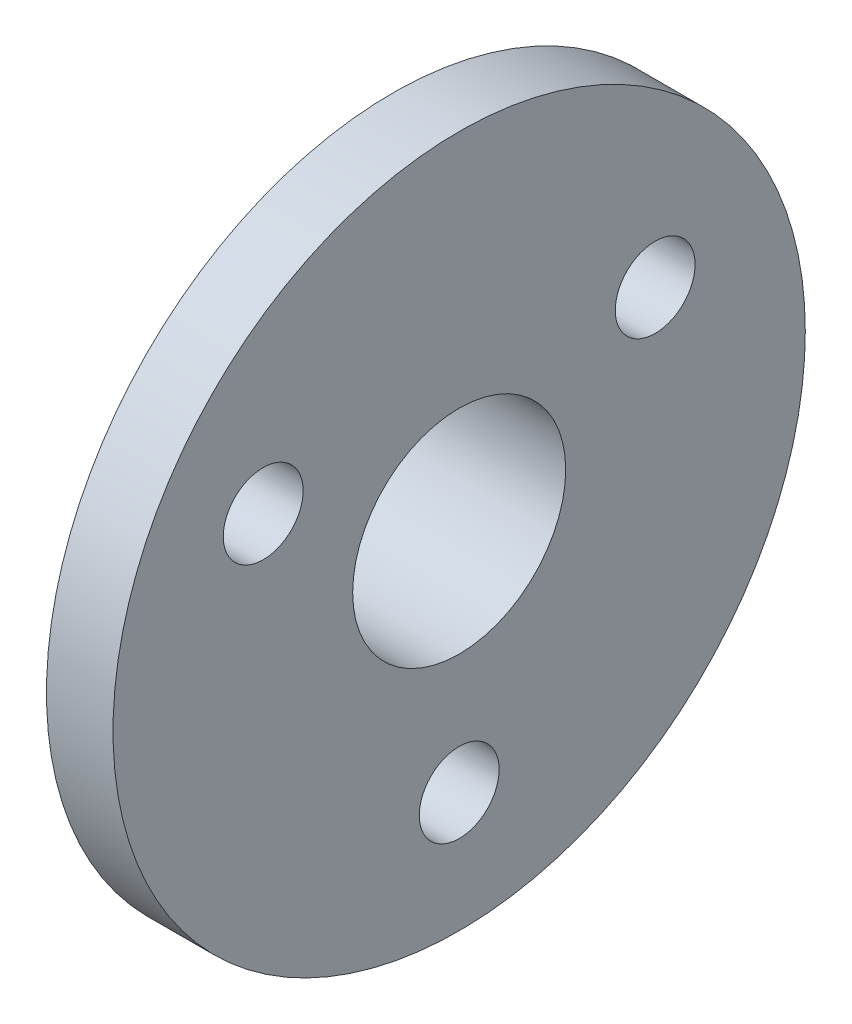
ISO-10303-21;
HEADER;
FILE_DESCRIPTION(('STEP AP214'),'2;1');
FILE_NAME('part.step','',(''),(''),'','','');
FILE_SCHEMA(('AUTOMOTIVE_DESIGN { 1 0 10303 214 1 1 1 1 }'));
ENDSEC;
DATA;
#1=APPLICATION_CONTEXT('core data for automotive mechanical design processes');
#2=APPLICATION_PROTOCOL_DEFINITION('international standard','automotive_design',2000,#1);
#3=PRODUCT_CONTEXT('',#1,'mechanical');
#4=PRODUCT('Part','Part','',(#3));
#5=PRODUCT_RELATED_PRODUCT_CATEGORY('part','',(#4));
#6=PRODUCT_DEFINITION_FORMATION('','',#4);
#7=PRODUCT_DEFINITION_CONTEXT('part definition',#1,'design');
#8=PRODUCT_DEFINITION('design','',#6,#7);
#9=PRODUCT_DEFINITION_SHAPE('','',#8);
#10=(LENGTH_UNIT() NAMED_UNIT(*) SI_UNIT(.MILLI.,.METRE.));
#11=(NAMED_UNIT(*) PLANE_ANGLE_UNIT() SI_UNIT($,.RADIAN.));
#12=(NAMED_UNIT(*) SI_UNIT($,.STERADIAN.) SOLID_ANGLE_UNIT());
#13=UNCERTAINTY_MEASURE_WITH_UNIT(LENGTH_MEASURE(1.E-05),#10,'distance_accuracy_value','');
#14=(GEOMETRIC_REPRESENTATION_CONTEXT(3) GLOBAL_UNCERTAINTY_ASSIGNED_CONTEXT((#13)) GLOBAL_UNIT_ASSIGNED_CONTEXT((#10,
#11,#12)) REPRESENTATION_CONTEXT('',''));
#15=CARTESIAN_POINT('',(0.,0.,0.));
#16=DIRECTION('',(0.,0.,1.));
#17=DIRECTION('',(1.,0.,0.));
#18=AXIS2_PLACEMENT_3D('',#15,#16,#17);
#19=CARTESIAN_POINT('',(7.,0.,0.));
#20=DIRECTION('',(-1.,0.,0.));
#21=DIRECTION('',(0.,0.,1.));
#22=AXIS2_PLACEMENT_3D('',#19,#20,#21);
#23=CYLINDRICAL_SURFACE('',#22,12.5);
#24=CARTESIAN_POINT('',(7.,0.,0.));
#25=DIRECTION('',(1.,0.,0.));
#26=DIRECTION('',(0.,0.,-1.));
#27=AXIS2_PLACEMENT_3D('',#24,#25,#26);
#28=CIRCLE('',#27,12.5);
#29=CARTESIAN_POINT('',(7.,0.,-12.5));
#30=VERTEX_POINT('',#29);
#31=EDGE_CURVE('E10',#30,#30,#28,.T.);
#32=ORIENTED_EDGE('',*,*,#31,.F.);
#33=EDGE_LOOP('',(#32));
#34=FACE_BOUND('',#33,.T.);
#35=CARTESIAN_POINT('',(0.,0.,0.));
#36=DIRECTION('',(1.,0.,0.));
#37=DIRECTION('',(0.,0.,-1.));
#38=AXIS2_PLACEMENT_3D('',#35,#36,#37);
#39=CIRCLE('',#38,12.5);
#40=CARTESIAN_POINT('',(0.,0.,-12.5));
#41=VERTEX_POINT('',#40);
#42=EDGE_CURVE('E49',#41,#41,#39,.T.);
#43=ORIENTED_EDGE('',*,*,#42,.T.);
#44=EDGE_LOOP('',(#43));
#45=FACE_BOUND('',#44,.T.);
#46=ADVANCED_FACE('F41',(#34,#45),#23,.T.);
#47=CARTESIAN_POINT('',(0.,0.,0.));
#48=DIRECTION('',(1.,0.,0.));
#49=DIRECTION('',(0.,0.,-1.));
#50=AXIS2_PLACEMENT_3D('',#47,#48,#49);
#51=PLANE('',#50);
#52=CARTESIAN_POINT('',(0.,0.,0.));
#53=DIRECTION('',(1.,0.,0.));
#54=DIRECTION('',(0.,0.,-1.));
#55=AXIS2_PLACEMENT_3D('',#52,#53,#54);
#56=CIRCLE('',#55,8.);
#57=CARTESIAN_POINT('',(0.,0.,-8.));
#58=VERTEX_POINT('',#57);
#59=EDGE_CURVE('E87',#58,#58,#56,.T.);
#60=ORIENTED_EDGE('',*,*,#59,.T.);
#61=EDGE_LOOP('',(#60));
#62=FACE_BOUND('',#61,.T.);
#63=ORIENTED_EDGE('',*,*,#42,.F.);
#64=EDGE_LOOP('',(#63));
#65=FACE_BOUND('',#64,.T.);
#66=ADVANCED_FACE('F120',(#62,#65),#51,.F.);
#67=CARTESIAN_POINT('',(12.,0.,0.));
#68=DIRECTION('',(-1.,0.,0.));
#69=DIRECTION('',(0.,0.,1.));
#70=AXIS2_PLACEMENT_3D('',#67,#68,#69);
#71=CYLINDRICAL_SURFACE('',#70,26.);
#72=CARTESIAN_POINT('',(12.,0.,0.));
#73=DIRECTION('',(1.,0.,0.));
#74=DIRECTION('',(0.,0.,-1.));
#75=AXIS2_PLACEMENT_3D('',#72,#73,#74);
#76=CIRCLE('',#75,26.);
#77=CARTESIAN_POINT('',(12.,0.,-26.));
#78=VERTEX_POINT('',#77);
#79=EDGE_CURVE('E55',#78,#78,#76,.T.);
#80=ORIENTED_EDGE('',*,*,#79,.F.);
#81=EDGE_LOOP('',(#80));
#82=FACE_BOUND('',#81,.T.);
#83=CARTESIAN_POINT('',(7.,0.,0.));
#84=DIRECTION('',(1.,0.,0.));
#85=DIRECTION('',(0.,0.,-1.));
#86=AXIS2_PLACEMENT_3D('',#83,#84,#85);
#87=CIRCLE('',#86,26.);
#88=CARTESIAN_POINT('',(7.,0.,-26.));
#89=VERTEX_POINT('',#88);
#90=EDGE_CURVE('E58',#89,#89,#87,.T.);
#91=ORIENTED_EDGE('',*,*,#90,.T.);
#92=EDGE_LOOP('',(#91));
#93=FACE_BOUND('',#92,.T.);
#94=ADVANCED_FACE('F101',(#82,#93),#71,.T.);
#95=CARTESIAN_POINT('',(12.,0.,0.));
#96=DIRECTION('',(1.,0.,0.));
#97=DIRECTION('',(0.,0.,-1.));
#98=AXIS2_PLACEMENT_3D('',#95,#96,#97);
#99=PLANE('',#98);
#100=CARTESIAN_POINT('',(12.,8.50000000000007,-14.7224318643354));
#101=DIRECTION('',(1.,0.,0.));
#102=DIRECTION('',(0.,0.866025403784436,0.500000000000004));
#103=AXIS2_PLACEMENT_3D('',#100,#101,#102);
#104=CIRCLE('',#103,3.);
#105=CARTESIAN_POINT('',(12.,11.0980762113534,-13.2224318643354));
#106=VERTEX_POINT('',#105);
#107=EDGE_CURVE('E69',#106,#106,#104,.T.);
#108=ORIENTED_EDGE('',*,*,#107,.F.);
#109=EDGE_LOOP('',(#108));
#110=FACE_BOUND('',#109,.T.);
#111=CARTESIAN_POINT('',(12.,8.49999999999986,14.7224318643355));
#112=DIRECTION('',(1.,0.,0.));
#113=DIRECTION('',(0.,-0.866025403784443,0.499999999999992));
#114=AXIS2_PLACEMENT_3D('',#111,#112,#113);
#115=CIRCLE('',#114,3.);
#116=CARTESIAN_POINT('',(12.,5.90192378864653,16.2224318643355));
#117=VERTEX_POINT('',#116);
#118=EDGE_CURVE('E76',#117,#117,#115,.T.);
#119=ORIENTED_EDGE('',*,*,#118,.F.);
#120=EDGE_LOOP('',(#119));
#121=FACE_BOUND('',#120,.T.);
#122=CARTESIAN_POINT('',(12.,-17.,0.));
#123=DIRECTION('',(1.,0.,0.));
#124=DIRECTION('',(0.,0.,-1.));
#125=AXIS2_PLACEMENT_3D('',#122,#123,#124);
#126=CIRCLE('',#125,3.);
#127=CARTESIAN_POINT('',(12.,-17.,-3.));
#128=VERTEX_POINT('',#127);
#129=EDGE_CURVE('E65',#128,#128,#126,.T.);
#130=ORIENTED_EDGE('',*,*,#129,.F.);
#131=EDGE_LOOP('',(#130));
#132=FACE_BOUND('',#131,.T.);
#133=CARTESIAN_POINT('',(12.,0.,0.));
#134=DIRECTION('',(1.,0.,0.));
#135=DIRECTION('',(0.,0.,-1.));
#136=AXIS2_PLACEMENT_3D('',#133,#134,#135);
#137=CIRCLE('',#136,8.);
#138=CARTESIAN_POINT('',(12.,0.,-8.));
#139=VERTEX_POINT('',#138);
#140=EDGE_CURVE('E64',#139,#139,#137,.T.);
#141=ORIENTED_EDGE('',*,*,#140,.F.);
#142=EDGE_LOOP('',(#141));
#143=FACE_BOUND('',#142,.T.);
#144=ORIENTED_EDGE('',*,*,#79,.T.);
#145=EDGE_LOOP('',(#144));
#146=FACE_BOUND('',#145,.T.);
#147=ADVANCED_FACE('F106',(#110,#121,#132,#143,#146),#99,.T.);
#148=CARTESIAN_POINT('',(7.,0.,0.));
#149=DIRECTION('',(1.,0.,0.));
#150=DIRECTION('',(0.,0.,-1.));
#151=AXIS2_PLACEMENT_3D('',#148,#149,#150);
#152=PLANE('',#151);
#153=CARTESIAN_POINT('',(7.,8.50000000000007,-14.7224318643354));
#154=DIRECTION('',(1.,0.,0.));
#155=DIRECTION('',(0.,0.,-1.));
#156=AXIS2_PLACEMENT_3D('',#153,#154,#155);
#157=CIRCLE('',#156,3.);
#158=CARTESIAN_POINT('',(7.,8.50000000000007,-17.7224318643354));
#159=VERTEX_POINT('',#158);
#160=EDGE_CURVE('E44',#159,#159,#157,.T.);
#161=ORIENTED_EDGE('',*,*,#160,.T.);
#162=EDGE_LOOP('',(#161));
#163=FACE_BOUND('',#162,.T.);
#164=CARTESIAN_POINT('',(7.,8.49999999999986,14.7224318643355));
#165=DIRECTION('',(1.,0.,0.));
#166=DIRECTION('',(0.,0.,-1.));
#167=AXIS2_PLACEMENT_3D('',#164,#165,#166);
#168=CIRCLE('',#167,3.);
#169=CARTESIAN_POINT('',(7.,8.49999999999986,11.7224318643355));
#170=VERTEX_POINT('',#169);
#171=EDGE_CURVE('E66',#170,#170,#168,.T.);
#172=ORIENTED_EDGE('',*,*,#171,.T.);
#173=EDGE_LOOP('',(#172));
#174=FACE_BOUND('',#173,.T.);
#175=CARTESIAN_POINT('',(7.,-17.,0.));
#176=DIRECTION('',(1.,0.,0.));
#177=DIRECTION('',(0.,0.,-1.));
#178=AXIS2_PLACEMENT_3D('',#175,#176,#177);
#179=CIRCLE('',#178,3.);
#180=CARTESIAN_POINT('',(7.,-17.,-3.));
#181=VERTEX_POINT('',#180);
#182=EDGE_CURVE('E61',#181,#181,#179,.T.);
#183=ORIENTED_EDGE('',*,*,#182,.T.);
#184=EDGE_LOOP('',(#183));
#185=FACE_BOUND('',#184,.T.);
#186=ORIENTED_EDGE('',*,*,#31,.T.);
#187=EDGE_LOOP('',(#186));
#188=FACE_BOUND('',#187,.T.);
#189=ORIENTED_EDGE('',*,*,#90,.F.);
#190=EDGE_LOOP('',(#189));
#191=FACE_BOUND('',#190,.T.);
#192=ADVANCED_FACE('F103',(#163,#174,#185,#188,#191),#152,.F.);
#193=CARTESIAN_POINT('',(0.,0.,0.));
#194=DIRECTION('',(1.,0.,0.));
#195=DIRECTION('',(0.,0.,-1.));
#196=AXIS2_PLACEMENT_3D('',#193,#194,#195);
#197=CYLINDRICAL_SURFACE('',#196,8.);
#198=ORIENTED_EDGE('',*,*,#59,.F.);
#199=EDGE_LOOP('',(#198));
#200=FACE_BOUND('',#199,.T.);
#201=ORIENTED_EDGE('',*,*,#140,.T.);
#202=EDGE_LOOP('',(#201));
#203=FACE_BOUND('',#202,.T.);
#204=ADVANCED_FACE('F105',(#200,#203),#197,.F.);
#205=CARTESIAN_POINT('',(0.,-17.,0.));
#206=DIRECTION('',(1.,0.,0.));
#207=DIRECTION('',(0.,0.,-1.));
#208=AXIS2_PLACEMENT_3D('',#205,#206,#207);
#209=CYLINDRICAL_SURFACE('',#208,3.);
#210=ORIENTED_EDGE('',*,*,#129,.T.);
#211=EDGE_LOOP('',(#210));
#212=FACE_BOUND('',#211,.T.);
#213=ORIENTED_EDGE('',*,*,#182,.F.);
#214=EDGE_LOOP('',(#213));
#215=FACE_BOUND('',#214,.T.);
#216=ADVANCED_FACE('F113',(#212,#215),#209,.F.);
#217=CARTESIAN_POINT('',(0.,8.49999999999986,14.7224318643355));
#218=DIRECTION('',(1.,0.,0.));
#219=DIRECTION('',(0.,0.,-1.));
#220=AXIS2_PLACEMENT_3D('',#217,#218,#219);
#221=CYLINDRICAL_SURFACE('',#220,3.);
#222=ORIENTED_EDGE('',*,*,#118,.T.);
#223=EDGE_LOOP('',(#222));
#224=FACE_BOUND('',#223,.T.);
#225=ORIENTED_EDGE('',*,*,#171,.F.);
#226=EDGE_LOOP('',(#225));
#227=FACE_BOUND('',#226,.T.);
#228=ADVANCED_FACE('F160',(#224,#227),#221,.F.);
#229=CARTESIAN_POINT('',(0.,8.50000000000007,-14.7224318643354));
#230=DIRECTION('',(1.,0.,0.));
#231=DIRECTION('',(0.,0.,-1.));
#232=AXIS2_PLACEMENT_3D('',#229,#230,#231);
#233=CYLINDRICAL_SURFACE('',#232,3.);
#234=ORIENTED_EDGE('',*,*,#107,.T.);
#235=EDGE_LOOP('',(#234));
#236=FACE_BOUND('',#235,.T.);
#237=ORIENTED_EDGE('',*,*,#160,.F.);
#238=EDGE_LOOP('',(#237));
#239=FACE_BOUND('',#238,.T.);
#240=ADVANCED_FACE('F165',(#236,#239),#233,.F.);
#241=CLOSED_SHELL('',(#46,#66,#94,#147,#192,#204,#216,#228,#240));
#242=MANIFOLD_SOLID_BREP('B2',#241);
#243=ADVANCED_BREP_SHAPE_REPRESENTATION('',(#18,#242),#14);
#244=SHAPE_DEFINITION_REPRESENTATION(#9,#243);
ENDSEC;
END-ISO-10303-21;
